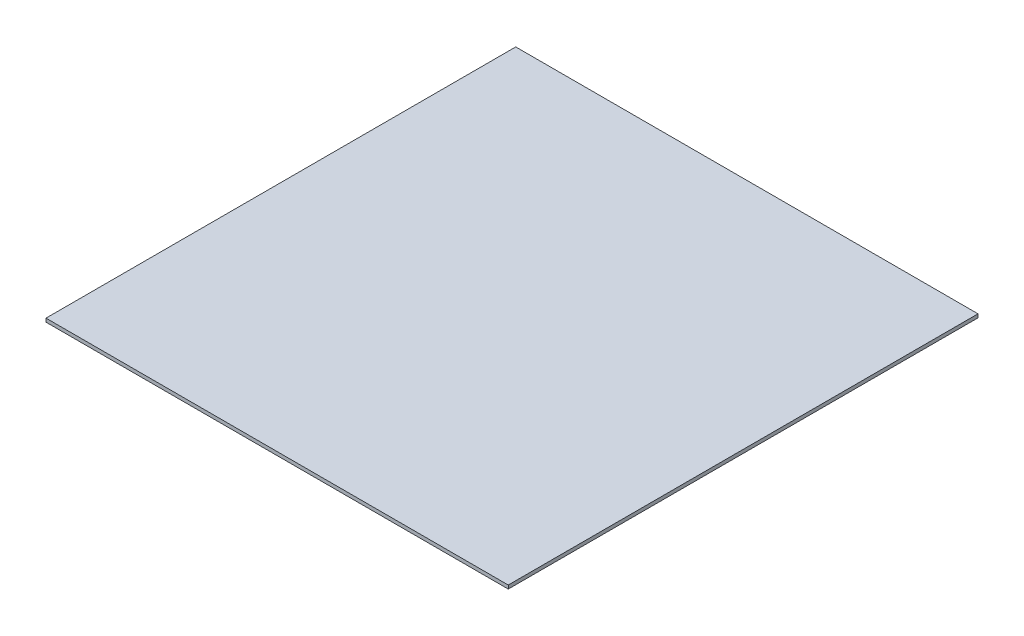
ISO-10303-21;
HEADER;
FILE_DESCRIPTION(('STEP AP214'),'2;1');
FILE_NAME('part.step','',(''),(''),'','','');
FILE_SCHEMA(('AUTOMOTIVE_DESIGN { 1 0 10303 214 1 1 1 1 }'));
ENDSEC;
DATA;
#1=APPLICATION_CONTEXT('core data for automotive mechanical design processes');
#2=APPLICATION_PROTOCOL_DEFINITION('international standard','automotive_design',2000,#1);
#3=PRODUCT_CONTEXT('',#1,'mechanical');
#4=PRODUCT('Part','Part','',(#3));
#5=PRODUCT_RELATED_PRODUCT_CATEGORY('part','',(#4));
#6=PRODUCT_DEFINITION_FORMATION('','',#4);
#7=PRODUCT_DEFINITION_CONTEXT('part definition',#1,'design');
#8=PRODUCT_DEFINITION('design','',#6,#7);
#9=PRODUCT_DEFINITION_SHAPE('','',#8);
#10=(LENGTH_UNIT() NAMED_UNIT(*) SI_UNIT(.MILLI.,.METRE.));
#11=(NAMED_UNIT(*) PLANE_ANGLE_UNIT() SI_UNIT($,.RADIAN.));
#12=(NAMED_UNIT(*) SI_UNIT($,.STERADIAN.) SOLID_ANGLE_UNIT());
#13=UNCERTAINTY_MEASURE_WITH_UNIT(LENGTH_MEASURE(1.E-05),#10,'distance_accuracy_value','');
#14=(GEOMETRIC_REPRESENTATION_CONTEXT(3) GLOBAL_UNCERTAINTY_ASSIGNED_CONTEXT((#13)) GLOBAL_UNIT_ASSIGNED_CONTEXT((#10,
#11,#12)) REPRESENTATION_CONTEXT('',''));
#15=CARTESIAN_POINT('',(0.,0.,0.));
#16=DIRECTION('',(0.,0.,1.));
#17=DIRECTION('',(1.,0.,0.));
#18=AXIS2_PLACEMENT_3D('',#15,#16,#17);
#19=CARTESIAN_POINT('',(-96.1895161147025,178.558823529412,396.822506071658));
#20=DIRECTION('',(0.,-1.,0.));
#21=DIRECTION('',(0.,0.,-1.));
#22=AXIS2_PLACEMENT_3D('',#19,#20,#21);
#23=PLANE('',#22);
#24=DIRECTION('',(1.,0.,0.));
#25=VECTOR('',#24,1.);
#26=CARTESIAN_POINT('',(-96.1895161147025,178.558823529412,200.));
#27=LINE('',#26,#25);
#28=CARTESIAN_POINT('',(-96.1895161147025,178.558823529412,200.));
#29=VERTEX_POINT('',#28);
#30=CARTESIAN_POINT('',(-293.006306293609,178.558823529412,200.));
#31=VERTEX_POINT('',#30);
#32=EDGE_CURVE('E79',#29,#31,#27,.F.);
#33=ORIENTED_EDGE('',*,*,#32,.F.);
#34=DIRECTION('',(0.,0.,-1.));
#35=VECTOR('',#34,1.);
#36=CARTESIAN_POINT('',(-96.1895161147025,178.558823529412,396.822506071658));
#37=LINE('',#36,#35);
#38=CARTESIAN_POINT('',(-96.1895161147025,178.558823529412,0.));
#39=VERTEX_POINT('',#38);
#40=EDGE_CURVE('E63',#29,#39,#37,.T.);
#41=ORIENTED_EDGE('',*,*,#40,.T.);
#42=DIRECTION('',(1.,0.,0.));
#43=VECTOR('',#42,1.);
#44=CARTESIAN_POINT('',(-96.1895161147025,178.558823529412,0.));
#45=LINE('',#44,#43);
#46=CARTESIAN_POINT('',(-293.006306293609,178.558823529412,0.));
#47=VERTEX_POINT('',#46);
#48=EDGE_CURVE('E92',#39,#47,#45,.F.);
#49=ORIENTED_EDGE('',*,*,#48,.T.);
#50=DIRECTION('',(0.,0.,-1.));
#51=VECTOR('',#50,1.);
#52=CARTESIAN_POINT('',(-293.006306293609,178.558823529412,396.822506071658));
#53=LINE('',#52,#51);
#54=EDGE_CURVE('E11',#31,#47,#53,.T.);
#55=ORIENTED_EDGE('',*,*,#54,.F.);
#56=EDGE_LOOP('',(#33,#41,#49,#55));
#57=FACE_BOUND('',#56,.T.);
#58=ADVANCED_FACE('F40',(#57),#23,.F.);
#59=CARTESIAN_POINT('',(-293.006306293609,177.058823529412,396.822506071658));
#60=DIRECTION('',(-1.,0.,0.));
#61=DIRECTION('',(0.,0.,1.));
#62=AXIS2_PLACEMENT_3D('',#59,#60,#61);
#63=PLANE('',#62);
#64=DIRECTION('',(0.,0.,-1.));
#65=VECTOR('',#64,1.);
#66=CARTESIAN_POINT('',(-293.006306293609,177.058823529412,396.822506071658));
#67=LINE('',#66,#65);
#68=CARTESIAN_POINT('',(-293.006306293609,177.058823529412,200.));
#69=VERTEX_POINT('',#68);
#70=CARTESIAN_POINT('',(-293.006306293609,177.058823529412,0.));
#71=VERTEX_POINT('',#70);
#72=EDGE_CURVE('E48',#69,#71,#67,.T.);
#73=ORIENTED_EDGE('',*,*,#72,.F.);
#74=DIRECTION('',(0.,-1.,0.));
#75=VECTOR('',#74,1.);
#76=CARTESIAN_POINT('',(-293.006306293609,177.058823529412,200.));
#77=LINE('',#76,#75);
#78=EDGE_CURVE('E82',#69,#31,#77,.F.);
#79=ORIENTED_EDGE('',*,*,#78,.T.);
#80=ORIENTED_EDGE('',*,*,#54,.T.);
#81=DIRECTION('',(0.,1.,0.));
#82=VECTOR('',#81,1.);
#83=CARTESIAN_POINT('',(-293.006306293609,177.058823529412,0.));
#84=LINE('',#83,#82);
#85=EDGE_CURVE('E99',#71,#47,#84,.T.);
#86=ORIENTED_EDGE('',*,*,#85,.F.);
#87=EDGE_LOOP('',(#73,#79,#80,#86));
#88=FACE_BOUND('',#87,.T.);
#89=ADVANCED_FACE('F89',(#88),#63,.T.);
#90=CARTESIAN_POINT('',(-96.1895161147025,177.058823529412,396.822506071658));
#91=DIRECTION('',(0.,-1.,0.));
#92=DIRECTION('',(0.,0.,-1.));
#93=AXIS2_PLACEMENT_3D('',#90,#91,#92);
#94=PLANE('',#93);
#95=DIRECTION('',(0.,0.,-1.));
#96=VECTOR('',#95,1.);
#97=CARTESIAN_POINT('',(-96.1895161147025,177.058823529412,396.822506071658));
#98=LINE('',#97,#96);
#99=CARTESIAN_POINT('',(-96.1895161147025,177.058823529412,200.));
#100=VERTEX_POINT('',#99);
#101=CARTESIAN_POINT('',(-96.1895161147025,177.058823529412,0.));
#102=VERTEX_POINT('',#101);
#103=EDGE_CURVE('E117',#100,#102,#98,.T.);
#104=ORIENTED_EDGE('',*,*,#103,.F.);
#105=DIRECTION('',(-1.,0.,0.));
#106=VECTOR('',#105,1.);
#107=CARTESIAN_POINT('',(-96.1895161147025,177.058823529412,200.));
#108=LINE('',#107,#106);
#109=EDGE_CURVE('E55',#100,#69,#108,.T.);
#110=ORIENTED_EDGE('',*,*,#109,.T.);
#111=ORIENTED_EDGE('',*,*,#72,.T.);
#112=DIRECTION('',(-1.,0.,0.));
#113=VECTOR('',#112,1.);
#114=CARTESIAN_POINT('',(-96.1895161147025,177.058823529412,0.));
#115=LINE('',#114,#113);
#116=EDGE_CURVE('E104',#102,#71,#115,.T.);
#117=ORIENTED_EDGE('',*,*,#116,.F.);
#118=EDGE_LOOP('',(#104,#110,#111,#117));
#119=FACE_BOUND('',#118,.T.);
#120=ADVANCED_FACE('F123',(#119),#94,.T.);
#121=CARTESIAN_POINT('',(-96.1895161147025,178.558823529412,396.822506071658));
#122=DIRECTION('',(1.,0.,0.));
#123=DIRECTION('',(0.,0.,-1.));
#124=AXIS2_PLACEMENT_3D('',#121,#122,#123);
#125=PLANE('',#124);
#126=ORIENTED_EDGE('',*,*,#40,.F.);
#127=DIRECTION('',(0.,-1.,0.));
#128=VECTOR('',#127,1.);
#129=CARTESIAN_POINT('',(-96.1895161147025,177.058823529412,200.));
#130=LINE('',#129,#128);
#131=EDGE_CURVE('E83',#100,#29,#130,.F.);
#132=ORIENTED_EDGE('',*,*,#131,.F.);
#133=ORIENTED_EDGE('',*,*,#103,.T.);
#134=DIRECTION('',(0.,-1.,0.));
#135=VECTOR('',#134,1.);
#136=CARTESIAN_POINT('',(-96.1895161147025,178.558823529412,0.));
#137=LINE('',#136,#135);
#138=EDGE_CURVE('E109',#39,#102,#137,.T.);
#139=ORIENTED_EDGE('',*,*,#138,.F.);
#140=EDGE_LOOP('',(#126,#132,#133,#139));
#141=FACE_BOUND('',#140,.T.);
#142=ADVANCED_FACE('F133',(#141),#125,.T.);
#143=CARTESIAN_POINT('',(0.,0.,0.));
#144=DIRECTION('',(0.,0.,1.));
#145=DIRECTION('',(1.,0.,0.));
#146=AXIS2_PLACEMENT_3D('',#143,#144,#145);
#147=PLANE('',#146);
#148=ORIENTED_EDGE('',*,*,#48,.F.);
#149=ORIENTED_EDGE('',*,*,#138,.T.);
#150=ORIENTED_EDGE('',*,*,#116,.T.);
#151=ORIENTED_EDGE('',*,*,#85,.T.);
#152=EDGE_LOOP('',(#148,#149,#150,#151));
#153=FACE_BOUND('',#152,.T.);
#154=ADVANCED_FACE('F102',(#153),#147,.F.);
#155=CARTESIAN_POINT('',(-96.1895161147025,177.058823529412,200.));
#156=DIRECTION('',(0.,0.,1.));
#157=DIRECTION('',(-1.,0.,0.));
#158=AXIS2_PLACEMENT_3D('',#155,#156,#157);
#159=PLANE('',#158);
#160=ORIENTED_EDGE('',*,*,#78,.F.);
#161=ORIENTED_EDGE('',*,*,#109,.F.);
#162=ORIENTED_EDGE('',*,*,#131,.T.);
#163=ORIENTED_EDGE('',*,*,#32,.T.);
#164=EDGE_LOOP('',(#160,#161,#162,#163));
#165=FACE_BOUND('',#164,.T.);
#166=ADVANCED_FACE('F81',(#165),#159,.T.);
#167=CLOSED_SHELL('',(#58,#89,#120,#142,#154,#166));
#168=MANIFOLD_SOLID_BREP('B2',#167);
#169=ADVANCED_BREP_SHAPE_REPRESENTATION('',(#18,#168),#14);
#170=SHAPE_DEFINITION_REPRESENTATION(#9,#169);
ENDSEC;
END-ISO-10303-21;
